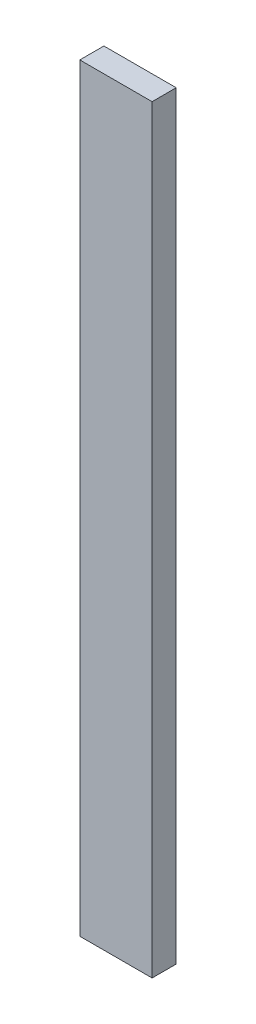
ISO-10303-21;
HEADER;
FILE_DESCRIPTION(('STEP AP214'),'2;1');
FILE_NAME('part.step','',(''),(''),'','','');
FILE_SCHEMA(('AUTOMOTIVE_DESIGN { 1 0 10303 214 1 1 1 1 }'));
ENDSEC;
DATA;
#1=APPLICATION_CONTEXT('core data for automotive mechanical design processes');
#2=APPLICATION_PROTOCOL_DEFINITION('international standard','automotive_design',2000,#1);
#3=PRODUCT_CONTEXT('',#1,'mechanical');
#4=PRODUCT('Part','Part','',(#3));
#5=PRODUCT_RELATED_PRODUCT_CATEGORY('part','',(#4));
#6=PRODUCT_DEFINITION_FORMATION('','',#4);
#7=PRODUCT_DEFINITION_CONTEXT('part definition',#1,'design');
#8=PRODUCT_DEFINITION('design','',#6,#7);
#9=PRODUCT_DEFINITION_SHAPE('','',#8);
#10=(LENGTH_UNIT() NAMED_UNIT(*) SI_UNIT(.MILLI.,.METRE.));
#11=(NAMED_UNIT(*) PLANE_ANGLE_UNIT() SI_UNIT($,.RADIAN.));
#12=(NAMED_UNIT(*) SI_UNIT($,.STERADIAN.) SOLID_ANGLE_UNIT());
#13=UNCERTAINTY_MEASURE_WITH_UNIT(LENGTH_MEASURE(1.E-05),#10,'distance_accuracy_value','');
#14=(GEOMETRIC_REPRESENTATION_CONTEXT(3) GLOBAL_UNCERTAINTY_ASSIGNED_CONTEXT((#13)) GLOBAL_UNIT_ASSIGNED_CONTEXT((#10,
#11,#12)) REPRESENTATION_CONTEXT('',''));
#15=CARTESIAN_POINT('',(0.,0.,0.));
#16=DIRECTION('',(0.,0.,1.));
#17=DIRECTION('',(1.,0.,0.));
#18=AXIS2_PLACEMENT_3D('',#15,#16,#17);
#19=CARTESIAN_POINT('',(0.,400.,0.));
#20=DIRECTION('',(1.,0.,0.));
#21=DIRECTION('',(0.,0.,-1.));
#22=AXIS2_PLACEMENT_3D('',#19,#20,#21);
#23=PLANE('',#22);
#24=DIRECTION('',(0.,0.,1.));
#25=VECTOR('',#24,1.);
#26=CARTESIAN_POINT('',(0.,0.,0.));
#27=LINE('',#26,#25);
#28=CARTESIAN_POINT('',(0.,0.,-12.7));
#29=VERTEX_POINT('',#28);
#30=CARTESIAN_POINT('',(0.,0.,0.));
#31=VERTEX_POINT('',#30);
#32=EDGE_CURVE('E99',#29,#31,#27,.T.);
#33=ORIENTED_EDGE('',*,*,#32,.T.);
#34=DIRECTION('',(0.,-1.,0.));
#35=VECTOR('',#34,1.);
#36=CARTESIAN_POINT('',(0.,400.,0.));
#37=LINE('',#36,#35);
#38=CARTESIAN_POINT('',(0.,400.,0.));
#39=VERTEX_POINT('',#38);
#40=EDGE_CURVE('E11',#39,#31,#37,.T.);
#41=ORIENTED_EDGE('',*,*,#40,.F.);
#42=DIRECTION('',(0.,0.,1.));
#43=VECTOR('',#42,1.);
#44=CARTESIAN_POINT('',(0.,400.,0.));
#45=LINE('',#44,#43);
#46=CARTESIAN_POINT('',(0.,400.,-12.7));
#47=VERTEX_POINT('',#46);
#48=EDGE_CURVE('E87',#47,#39,#45,.T.);
#49=ORIENTED_EDGE('',*,*,#48,.F.);
#50=DIRECTION('',(0.,-1.,0.));
#51=VECTOR('',#50,1.);
#52=CARTESIAN_POINT('',(0.,400.,-12.7));
#53=LINE('',#52,#51);
#54=EDGE_CURVE('E95',#47,#29,#53,.T.);
#55=ORIENTED_EDGE('',*,*,#54,.T.);
#56=EDGE_LOOP('',(#33,#41,#49,#55));
#57=FACE_BOUND('',#56,.T.);
#58=ADVANCED_FACE('F36',(#57),#23,.F.);
#59=CARTESIAN_POINT('',(0.,400.,0.));
#60=DIRECTION('',(0.,0.,-1.));
#61=DIRECTION('',(-1.,0.,0.));
#62=AXIS2_PLACEMENT_3D('',#59,#60,#61);
#63=PLANE('',#62);
#64=DIRECTION('',(1.,0.,0.));
#65=VECTOR('',#64,1.);
#66=CARTESIAN_POINT('',(0.,0.,0.));
#67=LINE('',#66,#65);
#68=CARTESIAN_POINT('',(38.1,0.,0.));
#69=VERTEX_POINT('',#68);
#70=EDGE_CURVE('E91',#31,#69,#67,.T.);
#71=ORIENTED_EDGE('',*,*,#70,.T.);
#72=DIRECTION('',(0.,-1.,0.));
#73=VECTOR('',#72,1.);
#74=CARTESIAN_POINT('',(38.1,400.,0.));
#75=LINE('',#74,#73);
#76=CARTESIAN_POINT('',(38.1,400.,0.));
#77=VERTEX_POINT('',#76);
#78=EDGE_CURVE('E44',#77,#69,#75,.T.);
#79=ORIENTED_EDGE('',*,*,#78,.F.);
#80=DIRECTION('',(1.,0.,0.));
#81=VECTOR('',#80,1.);
#82=CARTESIAN_POINT('',(0.,400.,0.));
#83=LINE('',#82,#81);
#84=EDGE_CURVE('E82',#39,#77,#83,.T.);
#85=ORIENTED_EDGE('',*,*,#84,.F.);
#86=ORIENTED_EDGE('',*,*,#40,.T.);
#87=EDGE_LOOP('',(#71,#79,#85,#86));
#88=FACE_BOUND('',#87,.T.);
#89=ADVANCED_FACE('F90',(#88),#63,.F.);
#90=CARTESIAN_POINT('',(38.1,400.,0.));
#91=DIRECTION('',(-1.,0.,0.));
#92=DIRECTION('',(0.,0.,1.));
#93=AXIS2_PLACEMENT_3D('',#90,#91,#92);
#94=PLANE('',#93);
#95=DIRECTION('',(0.,0.,-1.));
#96=VECTOR('',#95,1.);
#97=CARTESIAN_POINT('',(38.1,0.,0.));
#98=LINE('',#97,#96);
#99=CARTESIAN_POINT('',(38.1,0.,-12.7));
#100=VERTEX_POINT('',#99);
#101=EDGE_CURVE('E69',#69,#100,#98,.T.);
#102=ORIENTED_EDGE('',*,*,#101,.T.);
#103=DIRECTION('',(0.,-1.,0.));
#104=VECTOR('',#103,1.);
#105=CARTESIAN_POINT('',(38.1,400.,-12.7));
#106=LINE('',#105,#104);
#107=CARTESIAN_POINT('',(38.1,400.,-12.7));
#108=VERTEX_POINT('',#107);
#109=EDGE_CURVE('E92',#108,#100,#106,.T.);
#110=ORIENTED_EDGE('',*,*,#109,.F.);
#111=DIRECTION('',(0.,0.,-1.));
#112=VECTOR('',#111,1.);
#113=CARTESIAN_POINT('',(38.1,400.,0.));
#114=LINE('',#113,#112);
#115=EDGE_CURVE('E85',#77,#108,#114,.T.);
#116=ORIENTED_EDGE('',*,*,#115,.F.);
#117=ORIENTED_EDGE('',*,*,#78,.T.);
#118=EDGE_LOOP('',(#102,#110,#116,#117));
#119=FACE_BOUND('',#118,.T.);
#120=ADVANCED_FACE('F93',(#119),#94,.F.);
#121=CARTESIAN_POINT('',(0.,400.,-12.7));
#122=DIRECTION('',(0.,0.,1.));
#123=DIRECTION('',(1.,0.,0.));
#124=AXIS2_PLACEMENT_3D('',#121,#122,#123);
#125=PLANE('',#124);
#126=DIRECTION('',(-1.,0.,0.));
#127=VECTOR('',#126,1.);
#128=CARTESIAN_POINT('',(0.,0.,-12.7));
#129=LINE('',#128,#127);
#130=EDGE_CURVE('E75',#100,#29,#129,.T.);
#131=ORIENTED_EDGE('',*,*,#130,.T.);
#132=ORIENTED_EDGE('',*,*,#54,.F.);
#133=DIRECTION('',(-1.,0.,0.));
#134=VECTOR('',#133,1.);
#135=CARTESIAN_POINT('',(0.,400.,-12.7));
#136=LINE('',#135,#134);
#137=EDGE_CURVE('E52',#108,#47,#136,.T.);
#138=ORIENTED_EDGE('',*,*,#137,.F.);
#139=ORIENTED_EDGE('',*,*,#109,.T.);
#140=EDGE_LOOP('',(#131,#132,#138,#139));
#141=FACE_BOUND('',#140,.T.);
#142=ADVANCED_FACE('F106',(#141),#125,.F.);
#143=CARTESIAN_POINT('',(0.,400.,0.));
#144=DIRECTION('',(0.,-1.,0.));
#145=DIRECTION('',(0.,0.,-1.));
#146=AXIS2_PLACEMENT_3D('',#143,#144,#145);
#147=PLANE('',#146);
#148=ORIENTED_EDGE('',*,*,#48,.T.);
#149=ORIENTED_EDGE('',*,*,#84,.T.);
#150=ORIENTED_EDGE('',*,*,#115,.T.);
#151=ORIENTED_EDGE('',*,*,#137,.T.);
#152=EDGE_LOOP('',(#148,#149,#150,#151));
#153=FACE_BOUND('',#152,.T.);
#154=ADVANCED_FACE('F83',(#153),#147,.F.);
#155=CARTESIAN_POINT('',(0.,0.,0.));
#156=DIRECTION('',(0.,-1.,0.));
#157=DIRECTION('',(0.,0.,-1.));
#158=AXIS2_PLACEMENT_3D('',#155,#156,#157);
#159=PLANE('',#158);
#160=ORIENTED_EDGE('',*,*,#32,.F.);
#161=ORIENTED_EDGE('',*,*,#130,.F.);
#162=ORIENTED_EDGE('',*,*,#101,.F.);
#163=ORIENTED_EDGE('',*,*,#70,.F.);
#164=EDGE_LOOP('',(#160,#161,#162,#163));
#165=FACE_BOUND('',#164,.T.);
#166=ADVANCED_FACE('F109',(#165),#159,.T.);
#167=CLOSED_SHELL('',(#58,#89,#120,#142,#154,#166));
#168=MANIFOLD_SOLID_BREP('B2',#167);
#169=ADVANCED_BREP_SHAPE_REPRESENTATION('',(#18,#168),#14);
#170=SHAPE_DEFINITION_REPRESENTATION(#9,#169);
ENDSEC;
END-ISO-10303-21;
